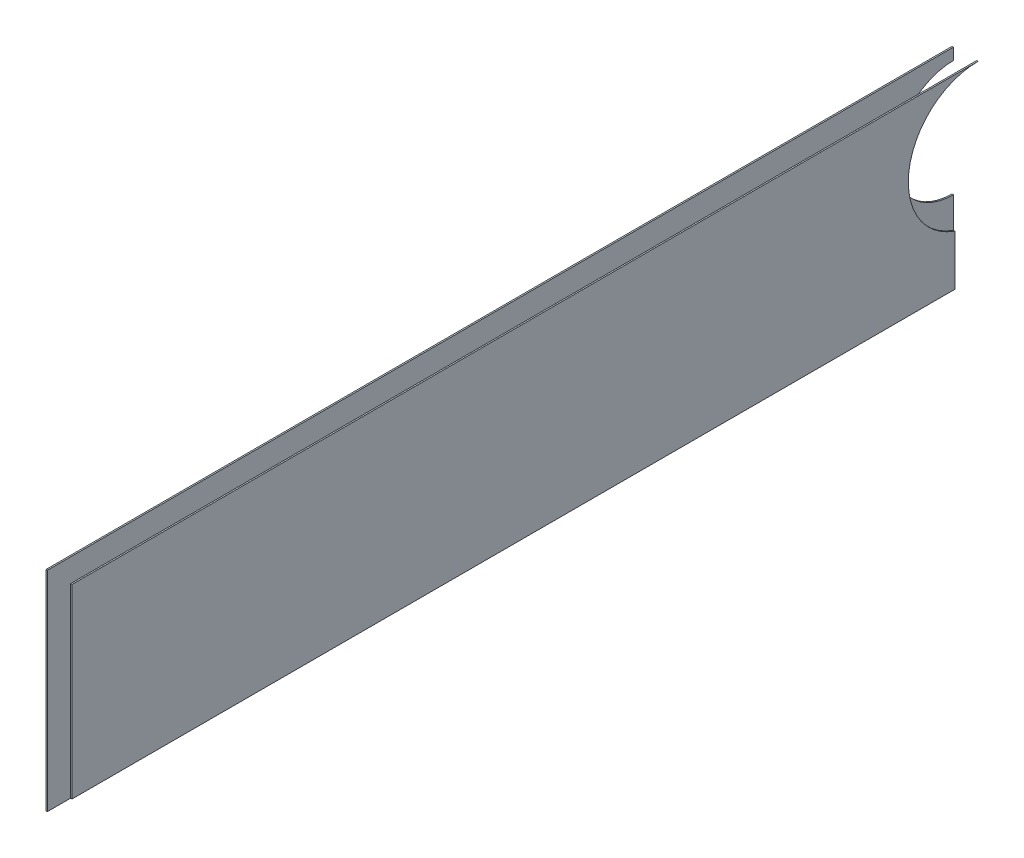
ISO-10303-21;
HEADER;
FILE_DESCRIPTION(('STEP AP214'),'2;1');
FILE_NAME('part.step','',(''),(''),'','','');
FILE_SCHEMA(('AUTOMOTIVE_DESIGN { 1 0 10303 214 1 1 1 1 }'));
ENDSEC;
DATA;
#1=APPLICATION_CONTEXT('core data for automotive mechanical design processes');
#2=APPLICATION_PROTOCOL_DEFINITION('international standard','automotive_design',2000,#1);
#3=PRODUCT_CONTEXT('',#1,'mechanical');
#4=PRODUCT('Part','Part','',(#3));
#5=PRODUCT_RELATED_PRODUCT_CATEGORY('part','',(#4));
#6=PRODUCT_DEFINITION_FORMATION('','',#4);
#7=PRODUCT_DEFINITION_CONTEXT('part definition',#1,'design');
#8=PRODUCT_DEFINITION('design','',#6,#7);
#9=PRODUCT_DEFINITION_SHAPE('','',#8);
#10=(LENGTH_UNIT() NAMED_UNIT(*) SI_UNIT(.MILLI.,.METRE.));
#11=(NAMED_UNIT(*) PLANE_ANGLE_UNIT() SI_UNIT($,.RADIAN.));
#12=(NAMED_UNIT(*) SI_UNIT($,.STERADIAN.) SOLID_ANGLE_UNIT());
#13=UNCERTAINTY_MEASURE_WITH_UNIT(LENGTH_MEASURE(1.E-05),#10,'distance_accuracy_value','');
#14=(GEOMETRIC_REPRESENTATION_CONTEXT(3) GLOBAL_UNCERTAINTY_ASSIGNED_CONTEXT((#13)) GLOBAL_UNIT_ASSIGNED_CONTEXT((#10,
#11,#12)) REPRESENTATION_CONTEXT('',''));
#15=CARTESIAN_POINT('',(0.,0.,0.));
#16=DIRECTION('',(0.,0.,1.));
#17=DIRECTION('',(1.,0.,0.));
#18=AXIS2_PLACEMENT_3D('',#15,#16,#17);
#19=CARTESIAN_POINT('',(-521.502987022629,700.,237.681641947689));
#20=DIRECTION('',(0.,1.,0.));
#21=DIRECTION('',(0.,0.,1.));
#22=AXIS2_PLACEMENT_3D('',#19,#20,#21);
#23=PLANE('',#22);
#24=DIRECTION('',(0.,0.,1.));
#25=VECTOR('',#24,1.);
#26=CARTESIAN_POINT('',(-521.202987022629,700.,237.681641947689));
#27=LINE('',#26,#25);
#28=CARTESIAN_POINT('',(-521.202987022629,700.,237.681641947689));
#29=VERTEX_POINT('',#28);
#30=CARTESIAN_POINT('',(-521.202987022629,700.,432.681641947689));
#31=VERTEX_POINT('',#30);
#32=EDGE_CURVE('E129',#29,#31,#27,.T.);
#33=ORIENTED_EDGE('',*,*,#32,.T.);
#34=DIRECTION('',(1.,0.,0.));
#35=VECTOR('',#34,1.);
#36=CARTESIAN_POINT('',(-521.502987022629,700.,432.681641947689));
#37=LINE('',#36,#35);
#38=CARTESIAN_POINT('',(-521.502987022629,700.,432.681641947689));
#39=VERTEX_POINT('',#38);
#40=EDGE_CURVE('E12',#39,#31,#37,.T.);
#41=ORIENTED_EDGE('',*,*,#40,.F.);
#42=DIRECTION('',(0.,0.,1.));
#43=VECTOR('',#42,1.);
#44=CARTESIAN_POINT('',(-521.502987022629,700.,237.681641947689));
#45=LINE('',#44,#43);
#46=CARTESIAN_POINT('',(-521.502987022629,700.,237.681641947689));
#47=VERTEX_POINT('',#46);
#48=EDGE_CURVE('E139',#47,#39,#45,.T.);
#49=ORIENTED_EDGE('',*,*,#48,.F.);
#50=DIRECTION('',(1.,0.,0.));
#51=VECTOR('',#50,1.);
#52=CARTESIAN_POINT('',(-521.502987022629,700.,237.681641947689));
#53=LINE('',#52,#51);
#54=EDGE_CURVE('E125',#47,#29,#53,.T.);
#55=ORIENTED_EDGE('',*,*,#54,.T.);
#56=EDGE_LOOP('',(#33,#41,#49,#55));
#57=FACE_BOUND('',#56,.T.);
#58=ADVANCED_FACE('F45',(#57),#23,.F.);
#59=CARTESIAN_POINT('',(-521.502987022629,700.,432.681641947689));
#60=DIRECTION('',(0.,0.,-1.));
#61=DIRECTION('',(-1.,0.,0.));
#62=AXIS2_PLACEMENT_3D('',#59,#60,#61);
#63=PLANE('',#62);
#64=DIRECTION('',(0.,1.,0.));
#65=VECTOR('',#64,1.);
#66=CARTESIAN_POINT('',(-521.202987022629,700.,432.681641947689));
#67=LINE('',#66,#65);
#68=CARTESIAN_POINT('',(-521.202987022629,745.,432.681641947689));
#69=VERTEX_POINT('',#68);
#70=EDGE_CURVE('E132',#31,#69,#67,.T.);
#71=ORIENTED_EDGE('',*,*,#70,.T.);
#72=DIRECTION('',(1.,0.,0.));
#73=VECTOR('',#72,1.);
#74=CARTESIAN_POINT('',(-521.502987022629,745.,432.681641947689));
#75=LINE('',#74,#73);
#76=CARTESIAN_POINT('',(-521.502987022629,745.,432.681641947689));
#77=VERTEX_POINT('',#76);
#78=EDGE_CURVE('E53',#77,#69,#75,.T.);
#79=ORIENTED_EDGE('',*,*,#78,.F.);
#80=DIRECTION('',(0.,1.,0.));
#81=VECTOR('',#80,1.);
#82=CARTESIAN_POINT('',(-521.502987022629,700.,432.681641947689));
#83=LINE('',#82,#81);
#84=EDGE_CURVE('E98',#39,#77,#83,.T.);
#85=ORIENTED_EDGE('',*,*,#84,.F.);
#86=ORIENTED_EDGE('',*,*,#40,.T.);
#87=EDGE_LOOP('',(#71,#79,#85,#86));
#88=FACE_BOUND('',#87,.T.);
#89=ADVANCED_FACE('F163',(#88),#63,.F.);
#90=CARTESIAN_POINT('',(-521.502987022629,745.,432.681641947689));
#91=DIRECTION('',(0.,-1.,0.));
#92=DIRECTION('',(0.,0.,-1.));
#93=AXIS2_PLACEMENT_3D('',#90,#91,#92);
#94=PLANE('',#93);
#95=DIRECTION('',(0.,0.,-1.));
#96=VECTOR('',#95,1.);
#97=CARTESIAN_POINT('',(-521.202987022629,745.,432.681641947689));
#98=LINE('',#97,#96);
#99=CARTESIAN_POINT('',(-521.202987022629,745.,237.681641947689));
#100=VERTEX_POINT('',#99);
#101=EDGE_CURVE('E134',#69,#100,#98,.T.);
#102=ORIENTED_EDGE('',*,*,#101,.T.);
#103=DIRECTION('',(1.,0.,0.));
#104=VECTOR('',#103,1.);
#105=CARTESIAN_POINT('',(-521.502987022629,745.,237.681641947689));
#106=LINE('',#105,#104);
#107=CARTESIAN_POINT('',(-521.502987022629,745.,237.681641947689));
#108=VERTEX_POINT('',#107);
#109=EDGE_CURVE('E120',#108,#100,#106,.T.);
#110=ORIENTED_EDGE('',*,*,#109,.F.);
#111=DIRECTION('',(0.,0.,-1.));
#112=VECTOR('',#111,1.);
#113=CARTESIAN_POINT('',(-521.502987022629,745.,432.681641947689));
#114=LINE('',#113,#112);
#115=EDGE_CURVE('E111',#77,#108,#114,.T.);
#116=ORIENTED_EDGE('',*,*,#115,.F.);
#117=ORIENTED_EDGE('',*,*,#78,.T.);
#118=EDGE_LOOP('',(#102,#110,#116,#117));
#119=FACE_BOUND('',#118,.T.);
#120=ADVANCED_FACE('F145',(#119),#94,.F.);
#121=CARTESIAN_POINT('',(-521.502987022629,745.,237.681641947689));
#122=DIRECTION('',(0.,0.,1.));
#123=DIRECTION('',(1.,0.,0.));
#124=AXIS2_PLACEMENT_3D('',#121,#122,#123);
#125=PLANE('',#124);
#126=DIRECTION('',(0.,-1.,0.));
#127=VECTOR('',#126,1.);
#128=CARTESIAN_POINT('',(-521.202987022629,745.,237.681641947689));
#129=LINE('',#128,#127);
#130=CARTESIAN_POINT('',(-521.202987022629,742.5,237.681641947689));
#131=VERTEX_POINT('',#130);
#132=EDGE_CURVE('E119',#100,#131,#129,.T.);
#133=ORIENTED_EDGE('',*,*,#132,.T.);
#134=DIRECTION('',(1.,0.,0.));
#135=VECTOR('',#134,1.);
#136=CARTESIAN_POINT('',(-521.502987022629,742.5,237.681641947689));
#137=LINE('',#136,#135);
#138=CARTESIAN_POINT('',(-521.502987022629,742.5,237.681641947689));
#139=VERTEX_POINT('',#138);
#140=EDGE_CURVE('E116',#139,#131,#137,.T.);
#141=ORIENTED_EDGE('',*,*,#140,.F.);
#142=DIRECTION('',(0.,-1.,0.));
#143=VECTOR('',#142,1.);
#144=CARTESIAN_POINT('',(-521.502987022629,745.,237.681641947689));
#145=LINE('',#144,#143);
#146=EDGE_CURVE('E105',#108,#139,#145,.T.);
#147=ORIENTED_EDGE('',*,*,#146,.F.);
#148=ORIENTED_EDGE('',*,*,#109,.T.);
#149=EDGE_LOOP('',(#133,#141,#147,#148));
#150=FACE_BOUND('',#149,.T.);
#151=ADVANCED_FACE('F117',(#150),#125,.F.);
#152=CARTESIAN_POINT('',(-521.502987022629,730.,237.681641947689));
#153=DIRECTION('',(1.,0.,0.));
#154=DIRECTION('',(0.,0.,-1.));
#155=AXIS2_PLACEMENT_3D('',#152,#153,#154);
#156=CYLINDRICAL_SURFACE('',#155,12.5);
#157=CARTESIAN_POINT('',(-521.202987022629,730.,237.681641947689));
#158=DIRECTION('',(1.,0.,0.));
#159=DIRECTION('',(0.,0.,1.));
#160=AXIS2_PLACEMENT_3D('',#157,#158,#159);
#161=CIRCLE('',#160,12.5);
#162=CARTESIAN_POINT('',(-521.202987022629,717.5,237.681641947689));
#163=VERTEX_POINT('',#162);
#164=EDGE_CURVE('E84',#131,#163,#161,.T.);
#165=ORIENTED_EDGE('',*,*,#164,.T.);
#166=DIRECTION('',(1.,0.,0.));
#167=VECTOR('',#166,1.);
#168=CARTESIAN_POINT('',(-521.502987022629,717.5,237.681641947689));
#169=LINE('',#168,#167);
#170=CARTESIAN_POINT('',(-521.502987022629,717.5,237.681641947689));
#171=VERTEX_POINT('',#170);
#172=EDGE_CURVE('E121',#171,#163,#169,.T.);
#173=ORIENTED_EDGE('',*,*,#172,.F.);
#174=CARTESIAN_POINT('',(-521.502987022629,730.,237.681641947689));
#175=DIRECTION('',(1.,0.,0.));
#176=DIRECTION('',(0.,0.,1.));
#177=AXIS2_PLACEMENT_3D('',#174,#175,#176);
#178=CIRCLE('',#177,12.5);
#179=EDGE_CURVE('E109',#139,#171,#178,.T.);
#180=ORIENTED_EDGE('',*,*,#179,.F.);
#181=ORIENTED_EDGE('',*,*,#140,.T.);
#182=EDGE_LOOP('',(#165,#173,#180,#181));
#183=FACE_BOUND('',#182,.T.);
#184=ADVANCED_FACE('F123',(#183),#156,.F.);
#185=CARTESIAN_POINT('',(-521.502987022629,717.5,237.681641947689));
#186=DIRECTION('',(0.,0.,1.));
#187=DIRECTION('',(1.,0.,0.));
#188=AXIS2_PLACEMENT_3D('',#185,#186,#187);
#189=PLANE('',#188);
#190=DIRECTION('',(0.,-1.,0.));
#191=VECTOR('',#190,1.);
#192=CARTESIAN_POINT('',(-521.202987022629,717.5,237.681641947689));
#193=LINE('',#192,#191);
#194=EDGE_CURVE('E90',#163,#29,#193,.T.);
#195=ORIENTED_EDGE('',*,*,#194,.T.);
#196=ORIENTED_EDGE('',*,*,#54,.F.);
#197=DIRECTION('',(0.,-1.,0.));
#198=VECTOR('',#197,1.);
#199=CARTESIAN_POINT('',(-521.502987022629,717.5,237.681641947689));
#200=LINE('',#199,#198);
#201=EDGE_CURVE('E61',#171,#47,#200,.T.);
#202=ORIENTED_EDGE('',*,*,#201,.F.);
#203=ORIENTED_EDGE('',*,*,#172,.T.);
#204=EDGE_LOOP('',(#195,#196,#202,#203));
#205=FACE_BOUND('',#204,.T.);
#206=ADVANCED_FACE('F152',(#205),#189,.F.);
#207=CARTESIAN_POINT('',(-521.502987022629,730.,237.681641947689));
#208=DIRECTION('',(-1.,0.,0.));
#209=DIRECTION('',(0.,0.,1.));
#210=AXIS2_PLACEMENT_3D('',#207,#208,#209);
#211=PLANE('',#210);
#212=ORIENTED_EDGE('',*,*,#48,.T.);
#213=ORIENTED_EDGE('',*,*,#84,.T.);
#214=ORIENTED_EDGE('',*,*,#115,.T.);
#215=ORIENTED_EDGE('',*,*,#146,.T.);
#216=ORIENTED_EDGE('',*,*,#179,.T.);
#217=ORIENTED_EDGE('',*,*,#201,.T.);
#218=EDGE_LOOP('',(#212,#213,#214,#215,#216,#217));
#219=FACE_BOUND('',#218,.T.);
#220=ADVANCED_FACE('F107',(#219),#211,.T.);
#221=CARTESIAN_POINT('',(-521.202987022629,730.,237.681641947689));
#222=DIRECTION('',(-1.,0.,0.));
#223=DIRECTION('',(0.,0.,1.));
#224=AXIS2_PLACEMENT_3D('',#221,#222,#223);
#225=PLANE('',#224);
#226=ORIENTED_EDGE('',*,*,#32,.F.);
#227=ORIENTED_EDGE('',*,*,#194,.F.);
#228=ORIENTED_EDGE('',*,*,#164,.F.);
#229=ORIENTED_EDGE('',*,*,#132,.F.);
#230=ORIENTED_EDGE('',*,*,#101,.F.);
#231=ORIENTED_EDGE('',*,*,#70,.F.);
#232=EDGE_LOOP('',(#226,#227,#228,#229,#230,#231));
#233=FACE_BOUND('',#232,.T.);
#234=ADVANCED_FACE('F148',(#233),#225,.F.);
#235=CLOSED_SHELL('',(#58,#89,#120,#151,#184,#206,#220,#234));
#236=MANIFOLD_SOLID_BREP('B2',#235);
#237=CARTESIAN_POINT('',(-515.90298702263,745.,432.681641947689));
#238=DIRECTION('',(0.,0.,-1.));
#239=DIRECTION('',(-1.,0.,0.));
#240=AXIS2_PLACEMENT_3D('',#237,#238,#239);
#241=PLANE('',#240);
#242=DIRECTION('',(0.,-1.,0.));
#243=VECTOR('',#242,1.);
#244=CARTESIAN_POINT('',(-516.202987022629,745.,432.681641947689));
#245=LINE('',#244,#243);
#246=CARTESIAN_POINT('',(-516.202987022629,745.,432.681641947689));
#247=VERTEX_POINT('',#246);
#248=CARTESIAN_POINT('',(-516.202987022629,705.,432.681641947689));
#249=VERTEX_POINT('',#248);
#250=EDGE_CURVE('E295',#247,#249,#245,.T.);
#251=ORIENTED_EDGE('',*,*,#250,.T.);
#252=DIRECTION('',(-1.,0.,0.));
#253=VECTOR('',#252,1.);
#254=CARTESIAN_POINT('',(-515.90298702263,705.,432.681641947689));
#255=LINE('',#254,#253);
#256=CARTESIAN_POINT('',(-515.90298702263,705.,432.681641947689));
#257=VERTEX_POINT('',#256);
#258=EDGE_CURVE('E43',#257,#249,#255,.T.);
#259=ORIENTED_EDGE('',*,*,#258,.F.);
#260=DIRECTION('',(0.,-1.,0.));
#261=VECTOR('',#260,1.);
#262=CARTESIAN_POINT('',(-515.90298702263,745.,432.681641947689));
#263=LINE('',#262,#261);
#264=CARTESIAN_POINT('',(-515.90298702263,745.,432.681641947689));
#265=VERTEX_POINT('',#264);
#266=EDGE_CURVE('E303',#265,#257,#263,.T.);
#267=ORIENTED_EDGE('',*,*,#266,.F.);
#268=DIRECTION('',(-1.,0.,0.));
#269=VECTOR('',#268,1.);
#270=CARTESIAN_POINT('',(-515.90298702263,745.,432.681641947689));
#271=LINE('',#270,#269);
#272=EDGE_CURVE('E291',#265,#247,#271,.T.);
#273=ORIENTED_EDGE('',*,*,#272,.T.);
#274=EDGE_LOOP('',(#251,#259,#267,#273));
#275=FACE_BOUND('',#274,.T.);
#276=ADVANCED_FACE('F221',(#275),#241,.F.);
#277=CARTESIAN_POINT('',(-515.90298702263,705.,432.681641947689));
#278=DIRECTION('',(0.,1.,0.));
#279=DIRECTION('',(0.,0.,1.));
#280=AXIS2_PLACEMENT_3D('',#277,#278,#279);
#281=PLANE('',#280);
#282=DIRECTION('',(0.,0.,-1.));
#283=VECTOR('',#282,1.);
#284=CARTESIAN_POINT('',(-516.202987022629,705.,432.681641947689));
#285=LINE('',#284,#283);
#286=CARTESIAN_POINT('',(-516.202987022629,705.,242.681641947689));
#287=VERTEX_POINT('',#286);
#288=EDGE_CURVE('E298',#249,#287,#285,.T.);
#289=ORIENTED_EDGE('',*,*,#288,.T.);
#290=DIRECTION('',(-1.,0.,0.));
#291=VECTOR('',#290,1.);
#292=CARTESIAN_POINT('',(-515.90298702263,705.,242.681641947689));
#293=LINE('',#292,#291);
#294=CARTESIAN_POINT('',(-515.90298702263,705.,242.681641947689));
#295=VERTEX_POINT('',#294);
#296=EDGE_CURVE('E229',#295,#287,#293,.T.);
#297=ORIENTED_EDGE('',*,*,#296,.F.);
#298=DIRECTION('',(0.,0.,-1.));
#299=VECTOR('',#298,1.);
#300=CARTESIAN_POINT('',(-515.90298702263,705.,432.681641947689));
#301=LINE('',#300,#299);
#302=EDGE_CURVE('E271',#257,#295,#301,.T.);
#303=ORIENTED_EDGE('',*,*,#302,.F.);
#304=ORIENTED_EDGE('',*,*,#258,.T.);
#305=EDGE_LOOP('',(#289,#297,#303,#304));
#306=FACE_BOUND('',#305,.T.);
#307=ADVANCED_FACE('F322',(#306),#281,.F.);
#308=CARTESIAN_POINT('',(-515.90298702263,705.,242.681641947689));
#309=DIRECTION('',(0.,0.,1.));
#310=DIRECTION('',(0.,-1.,0.));
#311=AXIS2_PLACEMENT_3D('',#308,#309,#310);
#312=PLANE('',#311);
#313=DIRECTION('',(0.,1.,0.));
#314=VECTOR('',#313,1.);
#315=CARTESIAN_POINT('',(-516.202987022629,705.,242.681641947689));
#316=LINE('',#315,#314);
#317=CARTESIAN_POINT('',(-516.202987022629,715.857864376269,242.681641947689));
#318=VERTEX_POINT('',#317);
#319=EDGE_CURVE('E286',#287,#318,#316,.T.);
#320=ORIENTED_EDGE('',*,*,#319,.T.);
#321=DIRECTION('',(-1.,0.,0.));
#322=VECTOR('',#321,1.);
#323=CARTESIAN_POINT('',(-515.90298702263,715.857864376269,242.681641947689));
#324=LINE('',#323,#322);
#325=CARTESIAN_POINT('',(-515.90298702263,715.857864376269,242.681641947689));
#326=VERTEX_POINT('',#325);
#327=EDGE_CURVE('E283',#326,#318,#324,.T.);
#328=ORIENTED_EDGE('',*,*,#327,.F.);
#329=DIRECTION('',(0.,1.,0.));
#330=VECTOR('',#329,1.);
#331=CARTESIAN_POINT('',(-515.90298702263,705.,242.681641947689));
#332=LINE('',#331,#330);
#333=EDGE_CURVE('E275',#295,#326,#332,.T.);
#334=ORIENTED_EDGE('',*,*,#333,.F.);
#335=ORIENTED_EDGE('',*,*,#296,.T.);
#336=EDGE_LOOP('',(#320,#328,#334,#335));
#337=FACE_BOUND('',#336,.T.);
#338=ADVANCED_FACE('F284',(#337),#312,.F.);
#339=CARTESIAN_POINT('',(-515.90298702263,730.,237.681641947689));
#340=DIRECTION('',(-1.,0.,0.));
#341=DIRECTION('',(0.,0.,1.));
#342=AXIS2_PLACEMENT_3D('',#339,#340,#341);
#343=CYLINDRICAL_SURFACE('',#342,15.);
#344=CARTESIAN_POINT('',(-516.202987022629,730.,237.681641947689));
#345=DIRECTION('',(-1.,0.,0.));
#346=DIRECTION('',(0.,0.,-1.));
#347=AXIS2_PLACEMENT_3D('',#344,#345,#346);
#348=CIRCLE('',#347,15.);
#349=CARTESIAN_POINT('',(-516.202987022629,745.,237.681641947689));
#350=VERTEX_POINT('',#349);
#351=EDGE_CURVE('E257',#318,#350,#348,.T.);
#352=ORIENTED_EDGE('',*,*,#351,.T.);
#353=DIRECTION('',(-1.,0.,0.));
#354=VECTOR('',#353,1.);
#355=CARTESIAN_POINT('',(-515.90298702263,745.,237.681641947689));
#356=LINE('',#355,#354);
#357=CARTESIAN_POINT('',(-515.90298702263,745.,237.681641947689));
#358=VERTEX_POINT('',#357);
#359=EDGE_CURVE('E287',#358,#350,#356,.T.);
#360=ORIENTED_EDGE('',*,*,#359,.F.);
#361=CARTESIAN_POINT('',(-515.90298702263,730.,237.681641947689));
#362=DIRECTION('',(-1.,0.,0.));
#363=DIRECTION('',(0.,0.,-1.));
#364=AXIS2_PLACEMENT_3D('',#361,#362,#363);
#365=CIRCLE('',#364,15.);
#366=EDGE_CURVE('E279',#326,#358,#365,.T.);
#367=ORIENTED_EDGE('',*,*,#366,.F.);
#368=ORIENTED_EDGE('',*,*,#327,.T.);
#369=EDGE_LOOP('',(#352,#360,#367,#368));
#370=FACE_BOUND('',#369,.T.);
#371=ADVANCED_FACE('F289',(#370),#343,.F.);
#372=CARTESIAN_POINT('',(-515.90298702263,745.,237.681641947689));
#373=DIRECTION('',(0.,-1.,0.));
#374=DIRECTION('',(0.,0.,-1.));
#375=AXIS2_PLACEMENT_3D('',#372,#373,#374);
#376=PLANE('',#375);
#377=DIRECTION('',(0.,0.,1.));
#378=VECTOR('',#377,1.);
#379=CARTESIAN_POINT('',(-516.202987022629,745.,237.681641947689));
#380=LINE('',#379,#378);
#381=EDGE_CURVE('E263',#350,#247,#380,.T.);
#382=ORIENTED_EDGE('',*,*,#381,.T.);
#383=ORIENTED_EDGE('',*,*,#272,.F.);
#384=DIRECTION('',(0.,0.,1.));
#385=VECTOR('',#384,1.);
#386=CARTESIAN_POINT('',(-515.90298702263,745.,237.681641947689));
#387=LINE('',#386,#385);
#388=EDGE_CURVE('E237',#358,#265,#387,.T.);
#389=ORIENTED_EDGE('',*,*,#388,.F.);
#390=ORIENTED_EDGE('',*,*,#359,.T.);
#391=EDGE_LOOP('',(#382,#383,#389,#390));
#392=FACE_BOUND('',#391,.T.);
#393=ADVANCED_FACE('F311',(#392),#376,.F.);
#394=CARTESIAN_POINT('',(-515.90298702263,730.,237.681641947689));
#395=DIRECTION('',(1.,0.,0.));
#396=DIRECTION('',(0.,0.,-1.));
#397=AXIS2_PLACEMENT_3D('',#394,#395,#396);
#398=PLANE('',#397);
#399=ORIENTED_EDGE('',*,*,#266,.T.);
#400=ORIENTED_EDGE('',*,*,#302,.T.);
#401=ORIENTED_EDGE('',*,*,#333,.T.);
#402=ORIENTED_EDGE('',*,*,#366,.T.);
#403=ORIENTED_EDGE('',*,*,#388,.T.);
#404=EDGE_LOOP('',(#399,#400,#401,#402,#403));
#405=FACE_BOUND('',#404,.T.);
#406=ADVANCED_FACE('F277',(#405),#398,.T.);
#407=CARTESIAN_POINT('',(-516.202987022629,730.,237.681641947689));
#408=DIRECTION('',(1.,0.,0.));
#409=DIRECTION('',(0.,0.,-1.));
#410=AXIS2_PLACEMENT_3D('',#407,#408,#409);
#411=PLANE('',#410);
#412=ORIENTED_EDGE('',*,*,#250,.F.);
#413=ORIENTED_EDGE('',*,*,#381,.F.);
#414=ORIENTED_EDGE('',*,*,#351,.F.);
#415=ORIENTED_EDGE('',*,*,#319,.F.);
#416=ORIENTED_EDGE('',*,*,#288,.F.);
#417=EDGE_LOOP('',(#412,#413,#414,#415,#416));
#418=FACE_BOUND('',#417,.T.);
#419=ADVANCED_FACE('F307',(#418),#411,.F.);
#420=CLOSED_SHELL('',(#276,#307,#338,#371,#393,#406,#419));
#421=MANIFOLD_SOLID_BREP('B6',#420);
#422=ADVANCED_BREP_SHAPE_REPRESENTATION('',(#18,#236,#421),#14);
#423=SHAPE_DEFINITION_REPRESENTATION(#9,#422);
ENDSEC;
END-ISO-10303-21;
